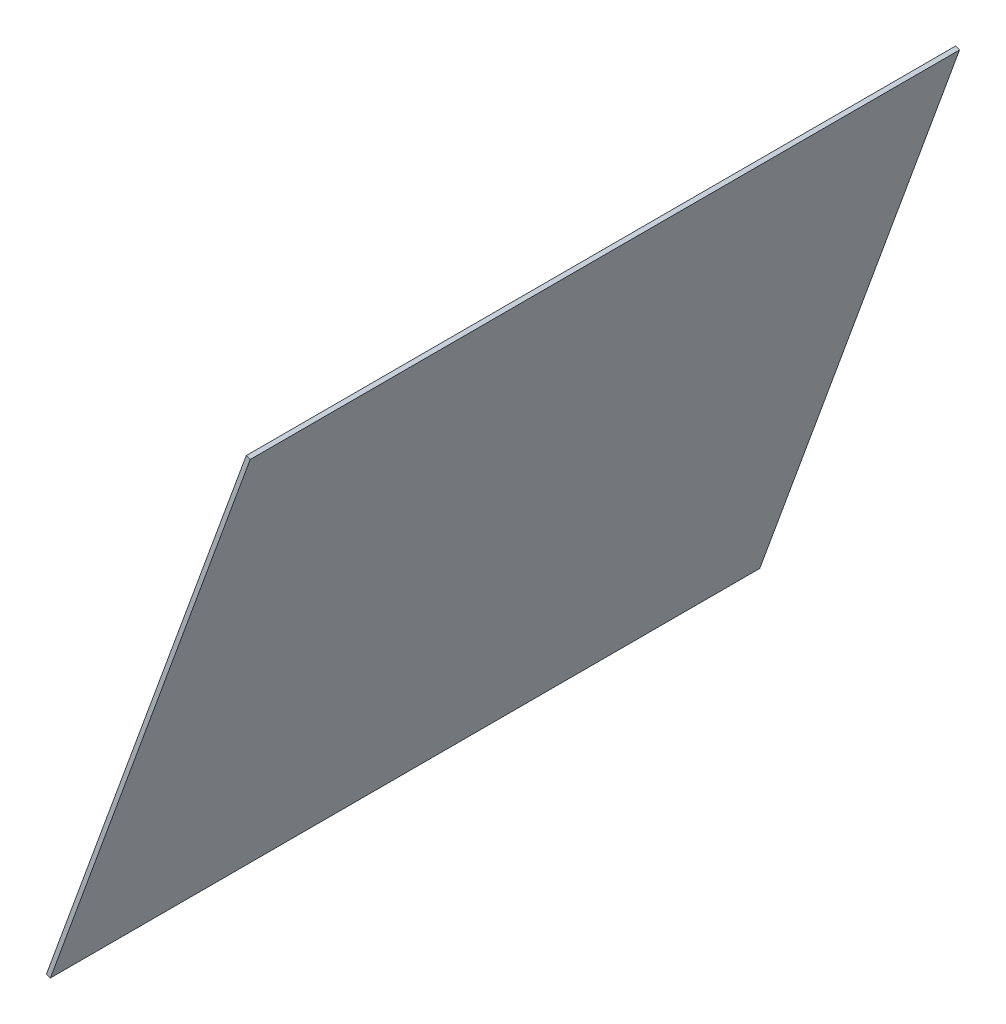
ISO-10303-21;
HEADER;
FILE_DESCRIPTION(('STEP AP214'),'2;1');
FILE_NAME('part.step','',(''),(''),'','','');
FILE_SCHEMA(('AUTOMOTIVE_DESIGN { 1 0 10303 214 1 1 1 1 }'));
ENDSEC;
DATA;
#1=APPLICATION_CONTEXT('core data for automotive mechanical design processes');
#2=APPLICATION_PROTOCOL_DEFINITION('international standard','automotive_design',2000,#1);
#3=PRODUCT_CONTEXT('',#1,'mechanical');
#4=PRODUCT('Part','Part','',(#3));
#5=PRODUCT_RELATED_PRODUCT_CATEGORY('part','',(#4));
#6=PRODUCT_DEFINITION_FORMATION('','',#4);
#7=PRODUCT_DEFINITION_CONTEXT('part definition',#1,'design');
#8=PRODUCT_DEFINITION('design','',#6,#7);
#9=PRODUCT_DEFINITION_SHAPE('','',#8);
#10=(LENGTH_UNIT() NAMED_UNIT(*) SI_UNIT(.MILLI.,.METRE.));
#11=(NAMED_UNIT(*) PLANE_ANGLE_UNIT() SI_UNIT($,.RADIAN.));
#12=(NAMED_UNIT(*) SI_UNIT($,.STERADIAN.) SOLID_ANGLE_UNIT());
#13=UNCERTAINTY_MEASURE_WITH_UNIT(LENGTH_MEASURE(1.E-05),#10,'distance_accuracy_value','');
#14=(GEOMETRIC_REPRESENTATION_CONTEXT(3) GLOBAL_UNCERTAINTY_ASSIGNED_CONTEXT((#13)) GLOBAL_UNIT_ASSIGNED_CONTEXT((#10,
#11,#12)) REPRESENTATION_CONTEXT('',''));
#15=CARTESIAN_POINT('',(0.,0.,0.));
#16=DIRECTION('',(0.,0.,1.));
#17=DIRECTION('',(1.,0.,0.));
#18=AXIS2_PLACEMENT_3D('',#15,#16,#17);
#19=CARTESIAN_POINT('',(-7.16551395275839,-56.2259240307313,-262.174205008662));
#20=DIRECTION('',(-0.342020143325669,-0.939692620785909,0.));
#21=DIRECTION('',(0.,0.,1.));
#22=AXIS2_PLACEMENT_3D('',#19,#20,#21);
#23=PLANE('',#22);
#24=DIRECTION('',(0.939692620785909,-0.342020143325669,0.));
#25=VECTOR('',#24,1.);
#26=CARTESIAN_POINT('',(-7.16551395275839,-56.2259240307313,-101.3));
#27=LINE('',#26,#25);
#28=CARTESIAN_POINT('',(-8.29314509770147,-55.8154998587405,-101.3));
#29=VERTEX_POINT('',#28);
#30=CARTESIAN_POINT('',(-7.16551395275839,-56.2259240307313,-101.3));
#31=VERTEX_POINT('',#30);
#32=EDGE_CURVE('E12',#29,#31,#27,.T.);
#33=ORIENTED_EDGE('',*,*,#32,.F.);
#34=DIRECTION('',(0.,0.,1.));
#35=VECTOR('',#34,1.);
#36=CARTESIAN_POINT('',(-8.29314509770147,-55.8154998587405,-262.174205008662));
#37=LINE('',#36,#35);
#38=CARTESIAN_POINT('',(-8.29314509770147,-55.8154998587405,101.3));
#39=VERTEX_POINT('',#38);
#40=EDGE_CURVE('E96',#29,#39,#37,.T.);
#41=ORIENTED_EDGE('',*,*,#40,.T.);
#42=DIRECTION('',(0.939692620785909,-0.342020143325669,0.));
#43=VECTOR('',#42,1.);
#44=CARTESIAN_POINT('',(-7.16551395275839,-56.2259240307313,101.3));
#45=LINE('',#44,#43);
#46=CARTESIAN_POINT('',(-7.16551395275839,-56.2259240307313,101.3));
#47=VERTEX_POINT('',#46);
#48=EDGE_CURVE('E55',#39,#47,#45,.T.);
#49=ORIENTED_EDGE('',*,*,#48,.T.);
#50=DIRECTION('',(0.,0.,1.));
#51=VECTOR('',#50,1.);
#52=CARTESIAN_POINT('',(-7.16551395275839,-56.2259240307313,-262.174205008662));
#53=LINE('',#52,#51);
#54=EDGE_CURVE('E121',#31,#47,#53,.T.);
#55=ORIENTED_EDGE('',*,*,#54,.F.);
#56=EDGE_LOOP('',(#33,#41,#49,#55));
#57=FACE_BOUND('',#56,.T.);
#58=ADVANCED_FACE('F45',(#57),#23,.F.);
#59=CARTESIAN_POINT('',(-7.16551395275839,-56.2259240307313,101.3));
#60=DIRECTION('',(0.,0.,-1.));
#61=DIRECTION('',(-0.342020143325669,-0.939692620785909,0.));
#62=AXIS2_PLACEMENT_3D('',#59,#60,#61);
#63=PLANE('',#62);
#64=ORIENTED_EDGE('',*,*,#48,.F.);
#65=DIRECTION('',(-0.342020143325669,-0.939692620785909,0.));
#66=VECTOR('',#65,1.);
#67=CARTESIAN_POINT('',(-8.29314509770147,-55.8154998587405,101.3));
#68=LINE('',#67,#66);
#69=CARTESIAN_POINT('',(-65.3545969350328,-212.590550303107,101.3));
#70=VERTEX_POINT('',#69);
#71=EDGE_CURVE('E89',#39,#70,#68,.T.);
#72=ORIENTED_EDGE('',*,*,#71,.T.);
#73=DIRECTION('',(0.939692620785909,-0.342020143325666,0.));
#74=VECTOR('',#73,1.);
#75=CARTESIAN_POINT('',(-64.2269657900897,-213.000974475098,101.3));
#76=LINE('',#75,#74);
#77=CARTESIAN_POINT('',(-64.2269657900897,-213.000974475098,101.3));
#78=VERTEX_POINT('',#77);
#79=EDGE_CURVE('E92',#70,#78,#76,.T.);
#80=ORIENTED_EDGE('',*,*,#79,.T.);
#81=DIRECTION('',(-0.342020143325669,-0.939692620785909,0.));
#82=VECTOR('',#81,1.);
#83=CARTESIAN_POINT('',(-7.16551395275839,-56.2259240307313,101.3));
#84=LINE('',#83,#82);
#85=EDGE_CURVE('E124',#47,#78,#84,.T.);
#86=ORIENTED_EDGE('',*,*,#85,.F.);
#87=EDGE_LOOP('',(#64,#72,#80,#86));
#88=FACE_BOUND('',#87,.T.);
#89=ADVANCED_FACE('F91',(#88),#63,.F.);
#90=CARTESIAN_POINT('',(-7.16551395275839,-56.2259240307313,-101.3));
#91=DIRECTION('',(0.,0.,-1.));
#92=DIRECTION('',(-0.342020143325669,-0.939692620785909,0.));
#93=AXIS2_PLACEMENT_3D('',#90,#91,#92);
#94=PLANE('',#93);
#95=DIRECTION('',(-0.342020143325669,-0.939692620785909,0.));
#96=VECTOR('',#95,1.);
#97=CARTESIAN_POINT('',(-8.29314509770147,-55.8154998587405,-101.3));
#98=LINE('',#97,#96);
#99=CARTESIAN_POINT('',(-65.3545969350328,-212.590550303107,-101.3));
#100=VERTEX_POINT('',#99);
#101=EDGE_CURVE('E80',#29,#100,#98,.T.);
#102=ORIENTED_EDGE('',*,*,#101,.F.);
#103=ORIENTED_EDGE('',*,*,#32,.T.);
#104=DIRECTION('',(-0.342020143325669,-0.939692620785909,0.));
#105=VECTOR('',#104,1.);
#106=CARTESIAN_POINT('',(-7.16551395275839,-56.2259240307313,-101.3));
#107=LINE('',#106,#105);
#108=CARTESIAN_POINT('',(-64.2269657900897,-213.000974475098,-101.3));
#109=VERTEX_POINT('',#108);
#110=EDGE_CURVE('E95',#31,#109,#107,.T.);
#111=ORIENTED_EDGE('',*,*,#110,.T.);
#112=DIRECTION('',(0.939692620785909,-0.342020143325666,0.));
#113=VECTOR('',#112,1.);
#114=CARTESIAN_POINT('',(-64.2269657900897,-213.000974475098,-101.3));
#115=LINE('',#114,#113);
#116=EDGE_CURVE('E116',#100,#109,#115,.T.);
#117=ORIENTED_EDGE('',*,*,#116,.F.);
#118=EDGE_LOOP('',(#102,#103,#111,#117));
#119=FACE_BOUND('',#118,.T.);
#120=ADVANCED_FACE('F141',(#119),#94,.T.);
#121=CARTESIAN_POINT('',(-10.8723688550568,-66.4104241719909,-262.174205008662));
#122=DIRECTION('',(-0.939692620785909,0.342020143325666,0.));
#123=DIRECTION('',(-0.342020143325666,-0.939692620785909,0.));
#124=AXIS2_PLACEMENT_3D('',#121,#122,#123);
#125=PLANE('',#124);
#126=ORIENTED_EDGE('',*,*,#110,.F.);
#127=ORIENTED_EDGE('',*,*,#54,.T.);
#128=ORIENTED_EDGE('',*,*,#85,.T.);
#129=DIRECTION('',(0.,0.,1.));
#130=VECTOR('',#129,1.);
#131=CARTESIAN_POINT('',(-64.2269657900897,-213.000974475098,-262.174205008662));
#132=LINE('',#131,#130);
#133=EDGE_CURVE('E104',#109,#78,#132,.T.);
#134=ORIENTED_EDGE('',*,*,#133,.F.);
#135=EDGE_LOOP('',(#126,#127,#128,#134));
#136=FACE_BOUND('',#135,.T.);
#137=ADVANCED_FACE('F47',(#136),#125,.F.);
#138=CARTESIAN_POINT('',(-8.29314509770147,-55.8154998587405,-262.174205008662));
#139=DIRECTION('',(-0.939692620785909,0.342020143325669,0.));
#140=DIRECTION('',(-0.342020143325669,-0.939692620785909,0.));
#141=AXIS2_PLACEMENT_3D('',#138,#139,#140);
#142=PLANE('',#141);
#143=ORIENTED_EDGE('',*,*,#101,.T.);
#144=DIRECTION('',(0.,0.,1.));
#145=VECTOR('',#144,1.);
#146=CARTESIAN_POINT('',(-65.3545969350328,-212.590550303107,-262.174205008662));
#147=LINE('',#146,#145);
#148=EDGE_CURVE('E102',#100,#70,#147,.T.);
#149=ORIENTED_EDGE('',*,*,#148,.T.);
#150=ORIENTED_EDGE('',*,*,#71,.F.);
#151=ORIENTED_EDGE('',*,*,#40,.F.);
#152=EDGE_LOOP('',(#143,#149,#150,#151));
#153=FACE_BOUND('',#152,.T.);
#154=ADVANCED_FACE('F107',(#153),#142,.T.);
#155=CARTESIAN_POINT('',(-64.2269657900897,-213.000974475098,-262.174205008662));
#156=DIRECTION('',(-0.342020143325666,-0.939692620785909,0.));
#157=DIRECTION('',(0.,0.,1.));
#158=AXIS2_PLACEMENT_3D('',#155,#156,#157);
#159=PLANE('',#158);
#160=ORIENTED_EDGE('',*,*,#79,.F.);
#161=ORIENTED_EDGE('',*,*,#148,.F.);
#162=ORIENTED_EDGE('',*,*,#116,.T.);
#163=ORIENTED_EDGE('',*,*,#133,.T.);
#164=EDGE_LOOP('',(#160,#161,#162,#163));
#165=FACE_BOUND('',#164,.T.);
#166=ADVANCED_FACE('F100',(#165),#159,.T.);
#167=CLOSED_SHELL('',(#58,#89,#120,#137,#154,#166));
#168=MANIFOLD_SOLID_BREP('B2',#167);
#169=ADVANCED_BREP_SHAPE_REPRESENTATION('',(#18,#168),#14);
#170=SHAPE_DEFINITION_REPRESENTATION(#9,#169);
ENDSEC;
END-ISO-10303-21;
